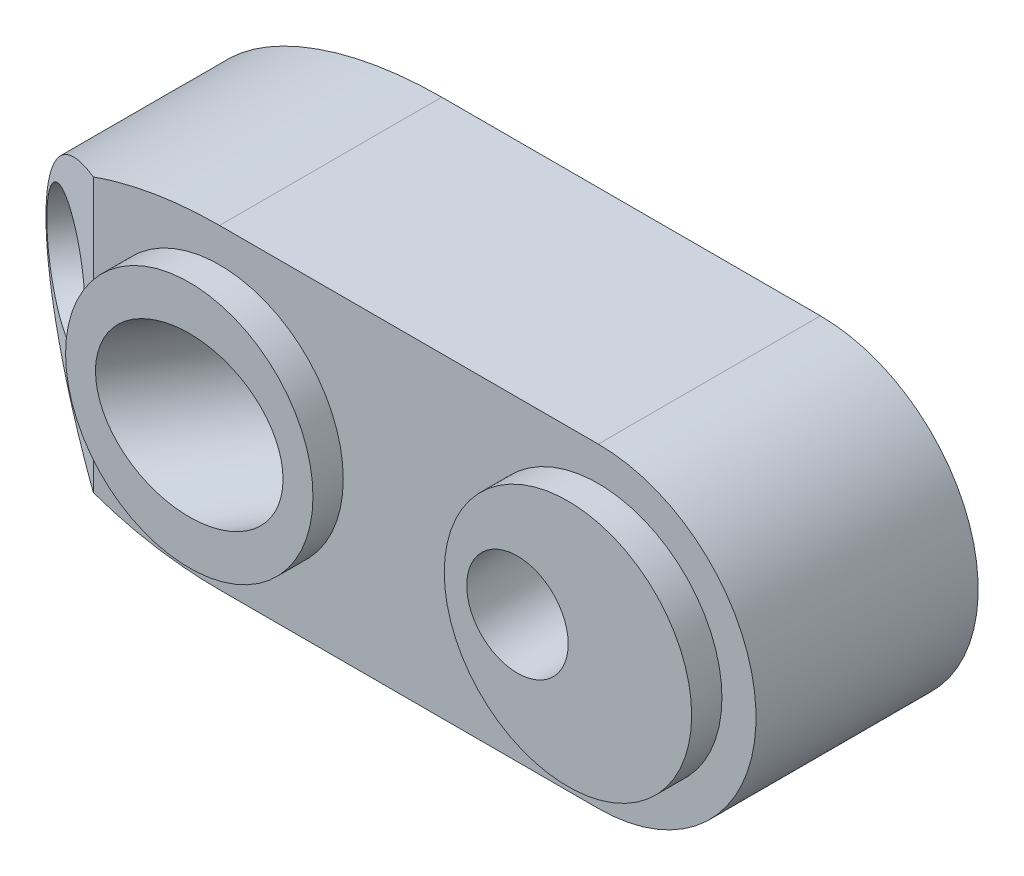
ISO-10303-21;
HEADER;
FILE_DESCRIPTION(('STEP AP214'),'2;1');
FILE_NAME('part.step','',(''),(''),'','','');
FILE_SCHEMA(('AUTOMOTIVE_DESIGN { 1 0 10303 214 1 1 1 1 }'));
ENDSEC;
DATA;
#1=APPLICATION_CONTEXT('core data for automotive mechanical design processes');
#2=APPLICATION_PROTOCOL_DEFINITION('international standard','automotive_design',2000,#1);
#3=PRODUCT_CONTEXT('',#1,'mechanical');
#4=PRODUCT('Part','Part','',(#3));
#5=PRODUCT_RELATED_PRODUCT_CATEGORY('part','',(#4));
#6=PRODUCT_DEFINITION_FORMATION('','',#4);
#7=PRODUCT_DEFINITION_CONTEXT('part definition',#1,'design');
#8=PRODUCT_DEFINITION('design','',#6,#7);
#9=PRODUCT_DEFINITION_SHAPE('','',#8);
#10=(LENGTH_UNIT() NAMED_UNIT(*) SI_UNIT(.MILLI.,.METRE.));
#11=(NAMED_UNIT(*) PLANE_ANGLE_UNIT() SI_UNIT($,.RADIAN.));
#12=(NAMED_UNIT(*) SI_UNIT($,.STERADIAN.) SOLID_ANGLE_UNIT());
#13=UNCERTAINTY_MEASURE_WITH_UNIT(LENGTH_MEASURE(1.E-05),#10,'distance_accuracy_value','');
#14=(GEOMETRIC_REPRESENTATION_CONTEXT(3) GLOBAL_UNCERTAINTY_ASSIGNED_CONTEXT((#13)) GLOBAL_UNIT_ASSIGNED_CONTEXT((#10,
#11,#12)) REPRESENTATION_CONTEXT('',''));
#15=CARTESIAN_POINT('',(0.,0.,0.));
#16=DIRECTION('',(0.,0.,1.));
#17=DIRECTION('',(1.,0.,0.));
#18=AXIS2_PLACEMENT_3D('',#15,#16,#17);
#19=CARTESIAN_POINT('',(13.2858215320146,0.,-21.26175894436));
#20=DIRECTION('',(-0.529919264233206,0.,0.848048096156425));
#21=DIRECTION('',(0.848048096156425,0.,0.529919264233206));
#22=AXIS2_PLACEMENT_3D('',#19,#20,#21);
#23=CYLINDRICAL_SURFACE('',#22,4.);
#24=CARTESIAN_POINT('',(0.,0.,0.));
#25=DIRECTION('',(0.,0.,1.));
#26=DIRECTION('',(-1.,0.,0.));
#27=AXIS2_PLACEMENT_3D('',#24,#25,#26);
#28=ELLIPSE('',#27,4.71671361344839,4.);
#29=CARTESIAN_POINT('',(-4.71671361344839,0.,0.));
#30=VERTEX_POINT('',#29);
#31=EDGE_CURVE('E231',#30,#30,#28,.T.);
#32=ORIENTED_EDGE('',*,*,#31,.T.);
#33=EDGE_LOOP('',(#32));
#34=FACE_BOUND('',#33,.T.);
#35=CARTESIAN_POINT('',(3.36498732788086,0.,-5.3851054105933));
#36=DIRECTION('',(0.529919264233206,0.,-0.848048096156425));
#37=DIRECTION('',(-0.848048096156425,0.,-0.529919264233206));
#38=AXIS2_PLACEMENT_3D('',#35,#36,#37);
#39=CIRCLE('',#38,4.);
#40=CARTESIAN_POINT('',(-0.0272050567448421,0.,-7.50478246752612));
#41=VERTEX_POINT('',#40);
#42=EDGE_CURVE('E236',#41,#41,#39,.F.);
#43=ORIENTED_EDGE('',*,*,#42,.F.);
#44=EDGE_LOOP('',(#43));
#45=FACE_BOUND('',#44,.T.);
#46=ADVANCED_FACE('F38',(#34,#45),#23,.F.);
#47=CARTESIAN_POINT('',(0.,0.,-12.7));
#48=DIRECTION('',(0.,0.,1.));
#49=DIRECTION('',(-1.,0.,0.));
#50=AXIS2_PLACEMENT_3D('',#47,#48,#49);
#51=ELLIPSE('',#50,12.7,7.9375);
#52=DIRECTION('',(0.,0.,1.));
#53=VECTOR('',#52,1.);
#54=SURFACE_OF_LINEAR_EXTRUSION('',#51,#53);
#55=CARTESIAN_POINT('',(-6.35,6.87407664253898,-1.524));
#56=CARTESIAN_POINT('',(-6.51816611880719,6.81338518049632,-1.62908185367215));
#57=CARTESIAN_POINT('',(-6.68558391575741,6.74976833327381,-1.73369610395053));
#58=CARTESIAN_POINT('',(-7.01868747338557,6.61636403292774,-1.94184230812433));
#59=CARTESIAN_POINT('',(-7.18437278419947,6.54657501952822,-2.04537398091351));
#60=CARTESIAN_POINT('',(-7.51347715020543,6.40063159622745,-2.25102121281018));
#61=CARTESIAN_POINT('',(-7.67689886284639,6.32448554835663,-2.35313843247605));
#62=CARTESIAN_POINT('',(-8.00132836939572,6.16540396988189,-2.55586448797379));
#63=CARTESIAN_POINT('',(-8.16233639970964,6.08246910940961,-2.65647347152825));
#64=CARTESIAN_POINT('',(-8.55954969250288,5.86711952518432,-2.90467988436573));
#65=CARTESIAN_POINT('',(-8.79406589923716,5.7303252797701,-3.05122187448001));
#66=CARTESIAN_POINT('',(-9.25563268129057,5.438975238535,-3.3396408104446));
#67=CARTESIAN_POINT('',(-9.48266897017626,5.28438773136629,-3.4815088291405));
#68=CARTESIAN_POINT('',(-9.88212939654059,4.98862997087603,-3.7311194068762));
#69=CARTESIAN_POINT('',(-10.0564055709391,4.85094496366641,-3.84001924702586));
#70=CARTESIAN_POINT('',(-10.3968187149178,4.56201187138487,-4.05273298768521));
#71=CARTESIAN_POINT('',(-10.562953158184,4.41075961719647,-4.15654530957883));
#72=CARTESIAN_POINT('',(-10.8846370801015,4.09385478138812,-4.35755573338701));
#73=CARTESIAN_POINT('',(-11.0402032280756,3.928225862534,-4.45476425145061));
#74=CARTESIAN_POINT('',(-11.3382063137202,3.58131979458901,-4.6409772464444));
#75=CARTESIAN_POINT('',(-11.4806524763065,3.40005381659166,-4.72998748774168));
#76=CARTESIAN_POINT('',(-11.6947918030297,3.09744109535082,-4.8637965900495));
#77=CARTESIAN_POINT('',(-11.7718713657381,2.98137149453306,-4.91196124644454));
#78=CARTESIAN_POINT('',(-11.9191669608155,2.74325673469362,-5.00400174947964));
#79=CARTESIAN_POINT('',(-11.9893817690746,2.62121051573518,-5.04787683121095));
#80=CARTESIAN_POINT('',(-12.1218140573784,2.37137132003248,-5.13062970937518));
#81=CARTESIAN_POINT('',(-12.1840393685578,2.24358413893516,-5.16951239924423));
#82=CARTESIAN_POINT('',(-12.2994098299088,1.9824842998304,-5.24160386465811));
#83=CARTESIAN_POINT('',(-12.3525601244485,1.84917482587167,-5.27481585476093));
#84=CARTESIAN_POINT('',(-12.4414819169458,1.59777683482077,-5.3303803576093));
#85=CARTESIAN_POINT('',(-12.4786629710276,1.48038167612661,-5.35361365877675));
#86=CARTESIAN_POINT('',(-12.544925588976,1.24249705679491,-5.39501913790994));
#87=CARTESIAN_POINT('',(-12.574010985879,1.12200909011957,-5.41319371102275));
#88=CARTESIAN_POINT('',(-12.6234814610519,0.878613312796133,-5.4441062947827));
#89=CARTESIAN_POINT('',(-12.6438699839982,0.755706480434465,-5.45684645790253));
#90=CARTESIAN_POINT('',(-12.675492906261,0.508256599919698,-5.4766066528424));
#91=CARTESIAN_POINT('',(-12.6867272847345,0.383713548041743,-5.48362667163822));
#92=CARTESIAN_POINT('',(-12.6997856730881,0.133550969765302,-5.49178645830572));
#93=CARTESIAN_POINT('',(-12.7015803636899,0.0079293018992031,-5.49290790545892));
#94=CARTESIAN_POINT('',(-12.6956348506076,-0.24299857249901,-5.48919273655244));
#95=CARTESIAN_POINT('',(-12.6878946030978,-0.3683047775785,-5.48435609310738));
#96=CARTESIAN_POINT('',(-12.6630686762476,-0.617663341682846,-5.46884313228591));
#97=CARTESIAN_POINT('',(-12.6459794990593,-0.741715213702437,-5.45816462921158));
#98=CARTESIAN_POINT('',(-12.6028616773382,-0.987629320865795,-5.43122162389698));
#99=CARTESIAN_POINT('',(-12.5768329399005,-1.10949153323954,-5.41495706360328));
#100=CARTESIAN_POINT('',(-12.5176022088443,-1.34552433370697,-5.37794559507509));
#101=CARTESIAN_POINT('',(-12.4847241661284,-1.45980860629301,-5.35740111383115));
#102=CARTESIAN_POINT('',(-12.4118418058726,-1.68519007839448,-5.31185916061252));
#103=CARTESIAN_POINT('',(-12.3718352860641,-1.79628628063866,-5.2868603125076));
#104=CARTESIAN_POINT('',(-12.2421057419194,-2.12412278892937,-5.20579629633441));
#105=CARTESIAN_POINT('',(-12.1426395172568,-2.33553882586884,-5.14364290099265));
#106=CARTESIAN_POINT('',(-11.8509387087167,-2.87559083157443,-4.96136800580873));
#107=CARTESIAN_POINT('',(-11.6405497684619,-3.19057856325733,-4.82990240506281));
#108=CARTESIAN_POINT('',(-11.2962331498496,-3.63113300488452,-4.61474950273894));
#109=CARTESIAN_POINT('',(-11.1764070655071,-3.77291129469782,-4.539873855074));
#110=CARTESIAN_POINT('',(-10.9287264956802,-4.04641248165546,-4.38510585792578));
#111=CARTESIAN_POINT('',(-10.8008726208293,-4.17813614191984,-4.30521389000856));
#112=CARTESIAN_POINT('',(-10.4482979525585,-4.51949012569428,-4.08490078554653));
#113=CARTESIAN_POINT('',(-10.2174703992624,-4.7203450360876,-3.94066372191563));
#114=CARTESIAN_POINT('',(-9.74197819664283,-5.09793375003444,-3.64354321742678));
#115=CARTESIAN_POINT('',(-9.49730296568522,-5.27464874538968,-3.49065316443003));
#116=CARTESIAN_POINT('',(-8.99734009137627,-5.60660266046975,-3.17824168718187));
#117=CARTESIAN_POINT('',(-8.7420389520059,-5.76181311324965,-3.0187118296818));
#118=CARTESIAN_POINT('',(-8.22368633667926,-6.05257439287649,-2.69480916688213));
#119=CARTESIAN_POINT('',(-7.96063799778347,-6.1881330491072,-2.5304383218355));
#120=CARTESIAN_POINT('',(-7.47357054664602,-6.41996831317173,-2.22608479930711));
#121=CARTESIAN_POINT('',(-7.2504883881751,-6.51900926332872,-2.08668759552085));
#122=CARTESIAN_POINT('',(-6.80203943803882,-6.70511740435602,-1.80646559068478));
#123=CARTESIAN_POINT('',(-6.57669022965159,-6.79224339565998,-1.66565177688656));
#124=CARTESIAN_POINT('',(-6.35,-6.87407664253898,-1.524));
#125=B_SPLINE_CURVE_WITH_KNOTS('',3,(#55,#56,#57,#58,#59,#60,#61,#62,#63,#64,#65,#66,#67,#68,
#69,#70,#71,#72,#73,#74,#75,#76,#77,#78,#79,#80,#81,#82,#83,#84,#85,#86,#87,#88,#89,#90,#91,#92,
#93,#94,#95,#96,#97,#98,#99,#100,#101,#102,#103,#104,#105,#106,#107,#108,#109,#110,#111,#112,
#113,#114,#115,#116,#117,#118,#119,#120,#121,#122,#123,#124),.UNSPECIFIED.,.F.,.F.,(4,2,2,2,2,2,
2,2,2,2,2,2,2,2,2,2,2,2,2,2,2,2,2,2,2,2,2,2,2,2,2,2,2,2,4),(0.,0.622128330823939,
1.24441438288875,1.86589440302214,2.48731314994164,3.41230399952307,4.33896967683031,
5.08058581766857,5.8224306376299,6.5630767934037,7.30319814629075,7.74517629971867,
8.18723312264794,8.62885328826024,9.07022227480508,9.44579708271204,9.82119376421449,
10.1964416194222,10.5716903290304,10.9481038602337,11.3245191215656,11.7010753128997,
12.0776354177345,12.4393215638351,12.8011196434529,13.5243185694302,14.7199627317144,
15.3201581003843,15.9203078704098,16.9335034574533,17.9474840099032,18.9627942645696,
19.9776988957814,20.820679190297,21.6593364191596),.UNSPECIFIED.);
#126=CARTESIAN_POINT('',(-6.35,6.87407664253898,-1.524));
#127=VERTEX_POINT('',#126);
#128=CARTESIAN_POINT('',(-6.35,-6.87407664253898,-1.524));
#129=VERTEX_POINT('',#128);
#130=EDGE_CURVE('E60',#127,#129,#125,.T.);
#131=ORIENTED_EDGE('',*,*,#130,.F.);
#132=CARTESIAN_POINT('',(0.,0.,-1.524));
#133=DIRECTION('',(0.,0.,1.));
#134=DIRECTION('',(-1.,0.,0.));
#135=AXIS2_PLACEMENT_3D('',#132,#133,#134);
#136=ELLIPSE('',#135,12.7,7.9375);
#137=CARTESIAN_POINT('',(0.,7.9375,-1.524));
#138=VERTEX_POINT('',#137);
#139=EDGE_CURVE('E268',#127,#138,#136,.F.);
#140=ORIENTED_EDGE('',*,*,#139,.T.);
#141=DIRECTION('',(0.,0.,1.));
#142=VECTOR('',#141,1.);
#143=CARTESIAN_POINT('',(0.,7.9375,-12.7));
#144=LINE('',#143,#142);
#145=CARTESIAN_POINT('',(0.,7.9375,-12.7));
#146=VERTEX_POINT('',#145);
#147=EDGE_CURVE('E224',#146,#138,#144,.T.);
#148=ORIENTED_EDGE('',*,*,#147,.F.);
#149=CARTESIAN_POINT('',(0.,-7.9375,-12.7));
#150=VERTEX_POINT('',#149);
#151=EDGE_CURVE('E271',#146,#150,#51,.T.);
#152=ORIENTED_EDGE('',*,*,#151,.T.);
#153=DIRECTION('',(0.,0.,1.));
#154=VECTOR('',#153,1.);
#155=CARTESIAN_POINT('',(0.,-7.9375,-12.7));
#156=LINE('',#155,#154);
#157=CARTESIAN_POINT('',(0.,-7.9375,-1.524));
#158=VERTEX_POINT('',#157);
#159=EDGE_CURVE('E221',#150,#158,#156,.T.);
#160=ORIENTED_EDGE('',*,*,#159,.T.);
#161=EDGE_CURVE('E269',#158,#129,#136,.F.);
#162=ORIENTED_EDGE('',*,*,#161,.T.);
#163=EDGE_LOOP('',(#131,#140,#148,#152,#160,#162));
#164=FACE_BOUND('',#163,.T.);
#165=ADVANCED_FACE('F40',(#164),#54,.T.);
#166=CARTESIAN_POINT('',(0.,7.9375,-12.7));
#167=DIRECTION('',(0.,1.,0.));
#168=DIRECTION('',(0.,0.,1.));
#169=AXIS2_PLACEMENT_3D('',#166,#167,#168);
#170=PLANE('',#169);
#171=ORIENTED_EDGE('',*,*,#147,.T.);
#172=DIRECTION('',(1.,0.,0.));
#173=VECTOR('',#172,1.);
#174=CARTESIAN_POINT('',(0.,7.9375,-1.524));
#175=LINE('',#174,#173);
#176=CARTESIAN_POINT('',(19.05,7.9375,-1.524));
#177=VERTEX_POINT('',#176);
#178=EDGE_CURVE('E265',#138,#177,#175,.T.);
#179=ORIENTED_EDGE('',*,*,#178,.T.);
#180=DIRECTION('',(0.,0.,1.));
#181=VECTOR('',#180,1.);
#182=CARTESIAN_POINT('',(19.05,7.9375,-12.7));
#183=LINE('',#182,#181);
#184=CARTESIAN_POINT('',(19.05,7.9375,-12.7));
#185=VERTEX_POINT('',#184);
#186=EDGE_CURVE('E220',#185,#177,#183,.T.);
#187=ORIENTED_EDGE('',*,*,#186,.F.);
#188=DIRECTION('',(-1.,0.,0.));
#189=VECTOR('',#188,1.);
#190=CARTESIAN_POINT('',(0.,7.9375,-12.7));
#191=LINE('',#190,#189);
#192=EDGE_CURVE('E226',#185,#146,#191,.T.);
#193=ORIENTED_EDGE('',*,*,#192,.T.);
#194=EDGE_LOOP('',(#171,#179,#187,#193));
#195=FACE_BOUND('',#194,.T.);
#196=ADVANCED_FACE('F198',(#195),#170,.T.);
#197=CARTESIAN_POINT('',(19.05,0.,-12.7));
#198=DIRECTION('',(0.,0.,1.));
#199=DIRECTION('',(1.,0.,0.));
#200=AXIS2_PLACEMENT_3D('',#197,#198,#199);
#201=CYLINDRICAL_SURFACE('',#200,7.9375);
#202=ORIENTED_EDGE('',*,*,#186,.T.);
#203=CARTESIAN_POINT('',(19.05,0.,-1.524));
#204=DIRECTION('',(0.,0.,1.));
#205=DIRECTION('',(1.,0.,0.));
#206=AXIS2_PLACEMENT_3D('',#203,#204,#205);
#207=CIRCLE('',#206,7.9375);
#208=CARTESIAN_POINT('',(19.05,-7.9375,-1.524));
#209=VERTEX_POINT('',#208);
#210=EDGE_CURVE('E261',#177,#209,#207,.F.);
#211=ORIENTED_EDGE('',*,*,#210,.T.);
#212=DIRECTION('',(0.,0.,1.));
#213=VECTOR('',#212,1.);
#214=CARTESIAN_POINT('',(19.05,-7.9375,-12.7));
#215=LINE('',#214,#213);
#216=CARTESIAN_POINT('',(19.05,-7.9375,-12.7));
#217=VERTEX_POINT('',#216);
#218=EDGE_CURVE('E212',#217,#209,#215,.T.);
#219=ORIENTED_EDGE('',*,*,#218,.F.);
#220=CARTESIAN_POINT('',(19.05,0.,-12.7));
#221=DIRECTION('',(0.,0.,1.));
#222=DIRECTION('',(1.,0.,0.));
#223=AXIS2_PLACEMENT_3D('',#220,#221,#222);
#224=CIRCLE('',#223,7.9375);
#225=EDGE_CURVE('E276',#217,#185,#224,.T.);
#226=ORIENTED_EDGE('',*,*,#225,.T.);
#227=EDGE_LOOP('',(#202,#211,#219,#226));
#228=FACE_BOUND('',#227,.T.);
#229=ADVANCED_FACE('F201',(#228),#201,.T.);
#230=CARTESIAN_POINT('',(0.,-7.9375,-12.7));
#231=DIRECTION('',(0.,-1.,0.));
#232=DIRECTION('',(0.,0.,-1.));
#233=AXIS2_PLACEMENT_3D('',#230,#231,#232);
#234=PLANE('',#233);
#235=ORIENTED_EDGE('',*,*,#218,.T.);
#236=DIRECTION('',(-1.,0.,0.));
#237=VECTOR('',#236,1.);
#238=CARTESIAN_POINT('',(0.,-7.9375,-1.524));
#239=LINE('',#238,#237);
#240=EDGE_CURVE('E213',#209,#158,#239,.T.);
#241=ORIENTED_EDGE('',*,*,#240,.T.);
#242=ORIENTED_EDGE('',*,*,#159,.F.);
#243=DIRECTION('',(1.,0.,0.));
#244=VECTOR('',#243,1.);
#245=CARTESIAN_POINT('',(0.,-7.9375,-12.7));
#246=LINE('',#245,#244);
#247=EDGE_CURVE('E216',#150,#217,#246,.T.);
#248=ORIENTED_EDGE('',*,*,#247,.T.);
#249=EDGE_LOOP('',(#235,#241,#242,#248));
#250=FACE_BOUND('',#249,.T.);
#251=ADVANCED_FACE('F194',(#250),#234,.T.);
#252=CARTESIAN_POINT('',(0.,0.,-12.7));
#253=DIRECTION('',(0.,0.,1.));
#254=DIRECTION('',(1.,0.,0.));
#255=AXIS2_PLACEMENT_3D('',#252,#253,#254);
#256=PLANE('',#255);
#257=DIRECTION('',(0.,1.,0.));
#258=VECTOR('',#257,1.);
#259=CARTESIAN_POINT('',(14.42132198774,0.,-12.7));
#260=LINE('',#259,#258);
#261=CARTESIAN_POINT('',(14.42132198774,-5.5,-12.7));
#262=VERTEX_POINT('',#261);
#263=CARTESIAN_POINT('',(14.42132198774,-1.46754947143244,-12.7));
#264=VERTEX_POINT('',#263);
#265=EDGE_CURVE('E118',#262,#264,#260,.T.);
#266=ORIENTED_EDGE('',*,*,#265,.T.);
#267=CARTESIAN_POINT('',(16.51,0.,-12.7));
#268=DIRECTION('',(0.,0.,1.));
#269=DIRECTION('',(1.,0.,0.));
#270=AXIS2_PLACEMENT_3D('',#267,#268,#269);
#271=CIRCLE('',#270,2.5527);
#272=CARTESIAN_POINT('',(14.42132198774,1.46754947143245,-12.7));
#273=VERTEX_POINT('',#272);
#274=EDGE_CURVE('E54',#264,#273,#271,.T.);
#275=ORIENTED_EDGE('',*,*,#274,.T.);
#276=CARTESIAN_POINT('',(14.42132198774,5.5,-12.7));
#277=VERTEX_POINT('',#276);
#278=EDGE_CURVE('E115',#273,#277,#260,.T.);
#279=ORIENTED_EDGE('',*,*,#278,.T.);
#280=DIRECTION('',(-1.,0.,0.));
#281=VECTOR('',#280,1.);
#282=CARTESIAN_POINT('',(0.,5.5,-12.7));
#283=LINE('',#282,#281);
#284=CARTESIAN_POINT('',(-8.3412910598422,5.5,-12.7));
#285=VERTEX_POINT('',#284);
#286=EDGE_CURVE('E128',#277,#285,#283,.T.);
#287=ORIENTED_EDGE('',*,*,#286,.T.);
#288=DIRECTION('',(0.,1.,0.));
#289=VECTOR('',#288,1.);
#290=CARTESIAN_POINT('',(-8.3412910598422,0.,-12.7));
#291=LINE('',#290,#289);
#292=CARTESIAN_POINT('',(-8.34129105984221,-5.5,-12.7));
#293=VERTEX_POINT('',#292);
#294=EDGE_CURVE('E235',#293,#285,#291,.T.);
#295=ORIENTED_EDGE('',*,*,#294,.F.);
#296=DIRECTION('',(1.,0.,0.));
#297=VECTOR('',#296,1.);
#298=CARTESIAN_POINT('',(0.,-5.5,-12.7));
#299=LINE('',#298,#297);
#300=EDGE_CURVE('E126',#293,#262,#299,.T.);
#301=ORIENTED_EDGE('',*,*,#300,.T.);
#302=EDGE_LOOP('',(#266,#275,#279,#287,#295,#301));
#303=FACE_BOUND('',#302,.T.);
#304=ORIENTED_EDGE('',*,*,#151,.F.);
#305=ORIENTED_EDGE('',*,*,#192,.F.);
#306=ORIENTED_EDGE('',*,*,#225,.F.);
#307=ORIENTED_EDGE('',*,*,#247,.F.);
#308=EDGE_LOOP('',(#304,#305,#306,#307));
#309=FACE_BOUND('',#308,.T.);
#310=ADVANCED_FACE('F112',(#303,#309),#256,.F.);
#311=CARTESIAN_POINT('',(7.14375,0.,-1.524));
#312=DIRECTION('',(0.,0.,1.));
#313=DIRECTION('',(1.,0.,0.));
#314=AXIS2_PLACEMENT_3D('',#311,#312,#313);
#315=PLANE('',#314);
#316=DIRECTION('',(0.,1.,0.));
#317=VECTOR('',#316,1.);
#318=CARTESIAN_POINT('',(-6.35,0.,-1.524));
#319=LINE('',#318,#317);
#320=EDGE_CURVE('E48',#129,#127,#319,.T.);
#321=ORIENTED_EDGE('',*,*,#320,.F.);
#322=ORIENTED_EDGE('',*,*,#161,.F.);
#323=ORIENTED_EDGE('',*,*,#240,.F.);
#324=ORIENTED_EDGE('',*,*,#210,.F.);
#325=ORIENTED_EDGE('',*,*,#178,.F.);
#326=ORIENTED_EDGE('',*,*,#139,.F.);
#327=EDGE_LOOP('',(#321,#322,#323,#324,#325,#326));
#328=FACE_BOUND('',#327,.T.);
#329=CARTESIAN_POINT('',(19.05,0.,-1.524));
#330=DIRECTION('',(0.,0.,1.));
#331=DIRECTION('',(1.,0.,0.));
#332=AXIS2_PLACEMENT_3D('',#329,#330,#331);
#333=CIRCLE('',#332,6.223);
#334=CARTESIAN_POINT('',(25.273,0.,-1.524));
#335=VERTEX_POINT('',#334);
#336=EDGE_CURVE('E252',#335,#335,#333,.T.);
#337=ORIENTED_EDGE('',*,*,#336,.F.);
#338=EDGE_LOOP('',(#337));
#339=FACE_BOUND('',#338,.T.);
#340=CARTESIAN_POINT('',(0.,0.,-1.524));
#341=DIRECTION('',(0.,0.,1.));
#342=DIRECTION('',(1.,0.,0.));
#343=AXIS2_PLACEMENT_3D('',#340,#341,#342);
#344=CIRCLE('',#343,6.223);
#345=CARTESIAN_POINT('',(6.223,0.,-1.524));
#346=VERTEX_POINT('',#345);
#347=EDGE_CURVE('E258',#346,#346,#344,.T.);
#348=ORIENTED_EDGE('',*,*,#347,.F.);
#349=EDGE_LOOP('',(#348));
#350=FACE_BOUND('',#349,.T.);
#351=ADVANCED_FACE('F187',(#328,#339,#350),#315,.T.);
#352=CARTESIAN_POINT('',(0.,0.,-1.524));
#353=DIRECTION('',(0.,0.,1.));
#354=DIRECTION('',(1.,0.,0.));
#355=AXIS2_PLACEMENT_3D('',#352,#353,#354);
#356=CYLINDRICAL_SURFACE('',#355,6.223);
#357=ORIENTED_EDGE('',*,*,#347,.T.);
#358=EDGE_LOOP('',(#357));
#359=FACE_BOUND('',#358,.T.);
#360=CARTESIAN_POINT('',(0.,0.,0.));
#361=DIRECTION('',(0.,0.,1.));
#362=DIRECTION('',(1.,0.,0.));
#363=AXIS2_PLACEMENT_3D('',#360,#361,#362);
#364=CIRCLE('',#363,6.223);
#365=CARTESIAN_POINT('',(6.223,0.,0.));
#366=VERTEX_POINT('',#365);
#367=EDGE_CURVE('E255',#366,#366,#364,.T.);
#368=ORIENTED_EDGE('',*,*,#367,.F.);
#369=EDGE_LOOP('',(#368));
#370=FACE_BOUND('',#369,.T.);
#371=ADVANCED_FACE('F183',(#359,#370),#356,.T.);
#372=CARTESIAN_POINT('',(19.05,0.,-1.524));
#373=DIRECTION('',(0.,0.,1.));
#374=DIRECTION('',(1.,0.,0.));
#375=AXIS2_PLACEMENT_3D('',#372,#373,#374);
#376=CYLINDRICAL_SURFACE('',#375,6.223);
#377=ORIENTED_EDGE('',*,*,#336,.T.);
#378=EDGE_LOOP('',(#377));
#379=FACE_BOUND('',#378,.T.);
#380=CARTESIAN_POINT('',(19.05,0.,0.));
#381=DIRECTION('',(0.,0.,1.));
#382=DIRECTION('',(1.,0.,0.));
#383=AXIS2_PLACEMENT_3D('',#380,#381,#382);
#384=CIRCLE('',#383,6.223);
#385=CARTESIAN_POINT('',(25.273,0.,0.));
#386=VERTEX_POINT('',#385);
#387=EDGE_CURVE('E234',#386,#386,#384,.T.);
#388=ORIENTED_EDGE('',*,*,#387,.F.);
#389=EDGE_LOOP('',(#388));
#390=FACE_BOUND('',#389,.T.);
#391=ADVANCED_FACE('F179',(#379,#390),#376,.T.);
#392=CARTESIAN_POINT('',(0.,0.,0.));
#393=DIRECTION('',(0.,0.,1.));
#394=DIRECTION('',(1.,0.,0.));
#395=AXIS2_PLACEMENT_3D('',#392,#393,#394);
#396=PLANE('',#395);
#397=ORIENTED_EDGE('',*,*,#31,.F.);
#398=EDGE_LOOP('',(#397));
#399=FACE_BOUND('',#398,.T.);
#400=ORIENTED_EDGE('',*,*,#367,.T.);
#401=EDGE_LOOP('',(#400));
#402=FACE_BOUND('',#401,.T.);
#403=ADVANCED_FACE('F182',(#399,#402),#396,.T.);
#404=CARTESIAN_POINT('',(16.51,0.,0.));
#405=DIRECTION('',(0.,0.,1.));
#406=DIRECTION('',(1.,0.,0.));
#407=AXIS2_PLACEMENT_3D('',#404,#405,#406);
#408=CIRCLE('',#407,2.55269999999999);
#409=CARTESIAN_POINT('',(19.0627,0.,0.));
#410=VERTEX_POINT('',#409);
#411=EDGE_CURVE('E120',#410,#410,#408,.T.);
#412=ORIENTED_EDGE('',*,*,#411,.F.);
#413=EDGE_LOOP('',(#412));
#414=FACE_BOUND('',#413,.T.);
#415=ORIENTED_EDGE('',*,*,#387,.T.);
#416=EDGE_LOOP('',(#415));
#417=FACE_BOUND('',#416,.T.);
#418=ADVANCED_FACE('F174',(#414,#417),#396,.T.);
#419=CARTESIAN_POINT('',(17.950086060875,-5.5,-18.3472029910774));
#420=DIRECTION('',(0.,-1.,0.));
#421=DIRECTION('',(1.,0.,0.));
#422=AXIS2_PLACEMENT_3D('',#419,#420,#421);
#423=PLANE('',#422);
#424=DIRECTION('',(0.848048096156425,0.,0.529919264233206));
#425=VECTOR('',#424,1.);
#426=CARTESIAN_POINT('',(8.0292518567412,-5.5,-2.47054945731067));
#427=LINE('',#426,#425);
#428=CARTESIAN_POINT('',(8.0292518567412,-5.5,-2.47054945731067));
#429=VERTEX_POINT('',#428);
#430=EDGE_CURVE('E137',#293,#429,#427,.T.);
#431=ORIENTED_EDGE('',*,*,#430,.T.);
#432=DIRECTION('',(-0.529919264233206,0.,0.848048096156425));
#433=VECTOR('',#432,1.);
#434=CARTESIAN_POINT('',(17.950086060875,-5.5,-18.3472029910774));
#435=LINE('',#434,#433);
#436=EDGE_CURVE('E245',#262,#429,#435,.T.);
#437=ORIENTED_EDGE('',*,*,#436,.F.);
#438=ORIENTED_EDGE('',*,*,#300,.F.);
#439=EDGE_LOOP('',(#431,#437,#438));
#440=FACE_BOUND('',#439,.T.);
#441=ADVANCED_FACE('F168',(#440),#423,.F.);
#442=CARTESIAN_POINT('',(17.950086060875,5.5,-18.3472029910774));
#443=DIRECTION('',(0.,1.,0.));
#444=DIRECTION('',(-1.,0.,0.));
#445=AXIS2_PLACEMENT_3D('',#442,#443,#444);
#446=PLANE('',#445);
#447=DIRECTION('',(-0.529919264233206,0.,0.848048096156425));
#448=VECTOR('',#447,1.);
#449=CARTESIAN_POINT('',(17.950086060875,5.5,-18.3472029910774));
#450=LINE('',#449,#448);
#451=CARTESIAN_POINT('',(8.0292518567412,5.5,-2.47054945731067));
#452=VERTEX_POINT('',#451);
#453=EDGE_CURVE('E125',#277,#452,#450,.T.);
#454=ORIENTED_EDGE('',*,*,#453,.T.);
#455=DIRECTION('',(-0.848048096156425,0.,-0.529919264233206));
#456=VECTOR('',#455,1.);
#457=CARTESIAN_POINT('',(8.0292518567412,5.5,-2.47054945731067));
#458=LINE('',#457,#456);
#459=EDGE_CURVE('E242',#452,#285,#458,.T.);
#460=ORIENTED_EDGE('',*,*,#459,.T.);
#461=ORIENTED_EDGE('',*,*,#286,.F.);
#462=EDGE_LOOP('',(#454,#460,#461));
#463=FACE_BOUND('',#462,.T.);
#464=ADVANCED_FACE('F165',(#463),#446,.F.);
#465=CARTESIAN_POINT('',(17.950086060875,-5.5,-18.3472029910774));
#466=DIRECTION('',(0.848048096156425,0.,0.529919264233206));
#467=DIRECTION('',(0.529919264233206,0.,-0.848048096156425));
#468=AXIS2_PLACEMENT_3D('',#465,#466,#467);
#469=PLANE('',#468);
#470=ORIENTED_EDGE('',*,*,#278,.F.);
#471=CARTESIAN_POINT('',(16.51,0.,-16.0425835430685));
#472=DIRECTION('',(0.848048096156425,0.,0.529919264233206));
#473=DIRECTION('',(-0.529919264233206,0.,0.848048096156425));
#474=AXIS2_PLACEMENT_3D('',#471,#472,#473);
#475=ELLIPSE('',#474,4.81714889850957,2.55269999999999);
#476=EDGE_CURVE('E12',#273,#264,#475,.T.);
#477=ORIENTED_EDGE('',*,*,#476,.T.);
#478=ORIENTED_EDGE('',*,*,#265,.F.);
#479=ORIENTED_EDGE('',*,*,#436,.T.);
#480=DIRECTION('',(0.,1.,0.));
#481=VECTOR('',#480,1.);
#482=CARTESIAN_POINT('',(8.0292518567412,-5.5,-2.47054945731067));
#483=LINE('',#482,#481);
#484=EDGE_CURVE('E246',#429,#452,#483,.T.);
#485=ORIENTED_EDGE('',*,*,#484,.T.);
#486=ORIENTED_EDGE('',*,*,#453,.F.);
#487=EDGE_LOOP('',(#470,#477,#478,#479,#485,#486));
#488=FACE_BOUND('',#487,.T.);
#489=ADVANCED_FACE('F123',(#488),#469,.F.);
#490=CARTESIAN_POINT('',(3.36498732788086,0.,-5.3851054105933));
#491=DIRECTION('',(0.529919264233206,0.,-0.848048096156425));
#492=DIRECTION('',(-0.848048096156425,0.,-0.529919264233206));
#493=AXIS2_PLACEMENT_3D('',#490,#491,#492);
#494=PLANE('',#493);
#495=CARTESIAN_POINT('',(-5.5395176817616,0.,-10.949257685042));
#496=DIRECTION('',(0.529919264233206,0.,-0.848048096156425));
#497=DIRECTION('',(-0.848048096156425,0.,-0.529919264233206));
#498=AXIS2_PLACEMENT_3D('',#495,#496,#497);
#499=CIRCLE('',#498,1.905);
#500=CARTESIAN_POINT('',(-7.1550493049396,0.,-11.9587538834062));
#501=VERTEX_POINT('',#500);
#502=EDGE_CURVE('E132',#501,#501,#499,.T.);
#503=ORIENTED_EDGE('',*,*,#502,.F.);
#504=EDGE_LOOP('',(#503));
#505=FACE_BOUND('',#504,.T.);
#506=ORIENTED_EDGE('',*,*,#42,.T.);
#507=EDGE_LOOP('',(#506));
#508=FACE_BOUND('',#507,.T.);
#509=ORIENTED_EDGE('',*,*,#294,.T.);
#510=ORIENTED_EDGE('',*,*,#459,.F.);
#511=ORIENTED_EDGE('',*,*,#484,.F.);
#512=ORIENTED_EDGE('',*,*,#430,.F.);
#513=EDGE_LOOP('',(#509,#510,#511,#512));
#514=FACE_BOUND('',#513,.T.);
#515=ADVANCED_FACE('F160',(#505,#508,#514),#494,.T.);
#516=CARTESIAN_POINT('',(-12.7,-7.9375,-5.49192038462424));
#517=DIRECTION('',(0.529919264233206,0.,-0.848048096156425));
#518=DIRECTION('',(-0.848048096156425,0.,-0.529919264233206));
#519=AXIS2_PLACEMENT_3D('',#516,#517,#518);
#520=PLANE('',#519);
#521=CARTESIAN_POINT('',(-10.0027955553072,0.,-3.80651999130208));
#522=DIRECTION('',(0.529919264233206,0.,-0.848048096156425));
#523=DIRECTION('',(-0.848048096156425,0.,-0.529919264233206));
#524=AXIS2_PLACEMENT_3D('',#521,#522,#523);
#525=CIRCLE('',#524,3.048);
#526=CARTESIAN_POINT('',(-12.587646152392,0.,-5.42171390868489));
#527=VERTEX_POINT('',#526);
#528=EDGE_CURVE('E134',#527,#527,#525,.T.);
#529=ORIENTED_EDGE('',*,*,#528,.T.);
#530=EDGE_LOOP('',(#529));
#531=FACE_BOUND('',#530,.T.);
#532=ORIENTED_EDGE('',*,*,#130,.T.);
#533=ORIENTED_EDGE('',*,*,#320,.T.);
#534=EDGE_LOOP('',(#532,#533));
#535=FACE_BOUND('',#534,.T.);
#536=ADVANCED_FACE('F154',(#531,#535),#520,.F.);
#537=CARTESIAN_POINT('',(-10.0027955553072,0.,-3.80651999130208));
#538=DIRECTION('',(0.529919264233206,0.,-0.848048096156425));
#539=DIRECTION('',(-0.848048096156425,0.,-0.529919264233206));
#540=AXIS2_PLACEMENT_3D('',#537,#538,#539);
#541=CYLINDRICAL_SURFACE('',#540,3.048);
#542=ORIENTED_EDGE('',*,*,#528,.F.);
#543=EDGE_LOOP('',(#542));
#544=FACE_BOUND('',#543,.T.);
#545=CARTESIAN_POINT('',(-8.23150754406629,0.,-6.64117335656732));
#546=DIRECTION('',(0.529919264233206,0.,-0.848048096156425));
#547=DIRECTION('',(-0.848048096156425,0.,-0.529919264233206));
#548=AXIS2_PLACEMENT_3D('',#545,#546,#547);
#549=CIRCLE('',#548,3.048);
#550=CARTESIAN_POINT('',(-10.8163581411511,0.,-8.25636727395013));
#551=VERTEX_POINT('',#550);
#552=EDGE_CURVE('E140',#551,#551,#549,.T.);
#553=ORIENTED_EDGE('',*,*,#552,.T.);
#554=EDGE_LOOP('',(#553));
#555=FACE_BOUND('',#554,.T.);
#556=ADVANCED_FACE('F159',(#544,#555),#541,.F.);
#557=CARTESIAN_POINT('',(-10.8163581411511,0.,-8.25636727395013));
#558=DIRECTION('',(0.529919264233206,0.,-0.848048096156425));
#559=DIRECTION('',(-0.848048096156425,0.,-0.529919264233206));
#560=AXIS2_PLACEMENT_3D('',#557,#558,#559);
#561=PLANE('',#560);
#562=ORIENTED_EDGE('',*,*,#552,.F.);
#563=EDGE_LOOP('',(#562));
#564=FACE_BOUND('',#563,.T.);
#565=CARTESIAN_POINT('',(-8.23150754406629,0.,-6.64117335656732));
#566=DIRECTION('',(0.529919264233206,0.,-0.848048096156425));
#567=DIRECTION('',(-0.848048096156425,0.,-0.529919264233206));
#568=AXIS2_PLACEMENT_3D('',#565,#566,#567);
#569=CIRCLE('',#568,1.905);
#570=CARTESIAN_POINT('',(-9.84703916724429,0.,-7.65066955493158));
#571=VERTEX_POINT('',#570);
#572=EDGE_CURVE('E119',#571,#571,#569,.T.);
#573=ORIENTED_EDGE('',*,*,#572,.T.);
#574=EDGE_LOOP('',(#573));
#575=FACE_BOUND('',#574,.T.);
#576=ADVANCED_FACE('F306',(#564,#575),#561,.F.);
#577=CARTESIAN_POINT('',(-10.0027955553072,0.,-3.80651999130208));
#578=DIRECTION('',(0.529919264233206,0.,-0.848048096156425));
#579=DIRECTION('',(-0.848048096156425,0.,-0.529919264233206));
#580=AXIS2_PLACEMENT_3D('',#577,#578,#579);
#581=CYLINDRICAL_SURFACE('',#580,1.905);
#582=ORIENTED_EDGE('',*,*,#502,.T.);
#583=EDGE_LOOP('',(#582));
#584=FACE_BOUND('',#583,.T.);
#585=ORIENTED_EDGE('',*,*,#572,.F.);
#586=EDGE_LOOP('',(#585));
#587=FACE_BOUND('',#586,.T.);
#588=ADVANCED_FACE('F308',(#584,#587),#581,.F.);
#589=CARTESIAN_POINT('',(16.51,0.,0.));
#590=DIRECTION('',(0.,0.,1.));
#591=DIRECTION('',(1.,0.,0.));
#592=AXIS2_PLACEMENT_3D('',#589,#590,#591);
#593=CYLINDRICAL_SURFACE('',#592,2.55269999999999);
#594=ORIENTED_EDGE('',*,*,#411,.T.);
#595=EDGE_LOOP('',(#594));
#596=FACE_BOUND('',#595,.T.);
#597=ORIENTED_EDGE('',*,*,#274,.F.);
#598=ORIENTED_EDGE('',*,*,#476,.F.);
#599=EDGE_LOOP('',(#597,#598));
#600=FACE_BOUND('',#599,.T.);
#601=ADVANCED_FACE('F107',(#596,#600),#593,.F.);
#602=CLOSED_SHELL('',(#46,#165,#196,#229,#251,#310,#351,#371,#391,#403,#418,#441,#464,#489,#515,
#536,#556,#576,#588,#601));
#603=MANIFOLD_SOLID_BREP('B2',#602);
#604=ADVANCED_BREP_SHAPE_REPRESENTATION('',(#18,#603),#14);
#605=SHAPE_DEFINITION_REPRESENTATION(#9,#604);
ENDSEC;
END-ISO-10303-21;
